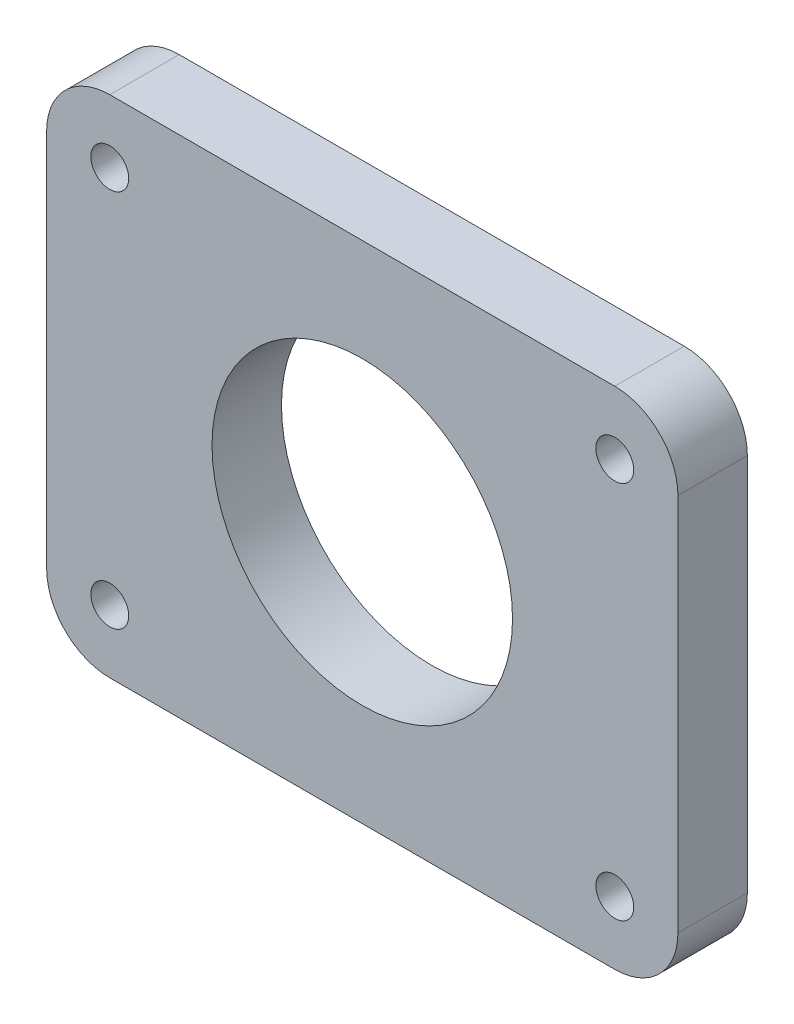
ISO-10303-21;
HEADER;
FILE_DESCRIPTION(('STEP AP214'),'2;1');
FILE_NAME('part.step','',(''),(''),'','','');
FILE_SCHEMA(('AUTOMOTIVE_DESIGN { 1 0 10303 214 1 1 1 1 }'));
ENDSEC;
DATA;
#1=APPLICATION_CONTEXT('core data for automotive mechanical design processes');
#2=APPLICATION_PROTOCOL_DEFINITION('international standard','automotive_design',2000,#1);
#3=PRODUCT_CONTEXT('',#1,'mechanical');
#4=PRODUCT('Part','Part','',(#3));
#5=PRODUCT_RELATED_PRODUCT_CATEGORY('part','',(#4));
#6=PRODUCT_DEFINITION_FORMATION('','',#4);
#7=PRODUCT_DEFINITION_CONTEXT('part definition',#1,'design');
#8=PRODUCT_DEFINITION('design','',#6,#7);
#9=PRODUCT_DEFINITION_SHAPE('','',#8);
#10=(LENGTH_UNIT() NAMED_UNIT(*) SI_UNIT(.MILLI.,.METRE.));
#11=(NAMED_UNIT(*) PLANE_ANGLE_UNIT() SI_UNIT($,.RADIAN.));
#12=(NAMED_UNIT(*) SI_UNIT($,.STERADIAN.) SOLID_ANGLE_UNIT());
#13=UNCERTAINTY_MEASURE_WITH_UNIT(LENGTH_MEASURE(1.E-05),#10,'distance_accuracy_value','');
#14=(GEOMETRIC_REPRESENTATION_CONTEXT(3) GLOBAL_UNCERTAINTY_ASSIGNED_CONTEXT((#13)) GLOBAL_UNIT_ASSIGNED_CONTEXT((#10,
#11,#12)) REPRESENTATION_CONTEXT('',''));
#15=CARTESIAN_POINT('',(0.,0.,0.));
#16=DIRECTION('',(0.,0.,1.));
#17=DIRECTION('',(1.,0.,0.));
#18=AXIS2_PLACEMENT_3D('',#15,#16,#17);
#19=CARTESIAN_POINT('',(-20.,-15.,5.5));
#20=DIRECTION('',(0.,0.,-1.));
#21=DIRECTION('',(-1.,0.,0.));
#22=AXIS2_PLACEMENT_3D('',#19,#20,#21);
#23=PLANE('',#22);
#24=CARTESIAN_POINT('',(-20.,-15.,5.5));
#25=DIRECTION('',(0.,0.,1.));
#26=DIRECTION('',(-1.,0.,0.));
#27=AXIS2_PLACEMENT_3D('',#24,#25,#26);
#28=CIRCLE('',#27,5.);
#29=CARTESIAN_POINT('',(-25.,-15.,5.5));
#30=VERTEX_POINT('',#29);
#31=CARTESIAN_POINT('',(-20.,-20.,5.5));
#32=VERTEX_POINT('',#31);
#33=EDGE_CURVE('E144',#30,#32,#28,.T.);
#34=ORIENTED_EDGE('',*,*,#33,.T.);
#35=DIRECTION('',(1.,0.,0.));
#36=VECTOR('',#35,1.);
#37=CARTESIAN_POINT('',(-20.,-20.,5.5));
#38=LINE('',#37,#36);
#39=CARTESIAN_POINT('',(20.,-20.,5.5));
#40=VERTEX_POINT('',#39);
#41=EDGE_CURVE('E92',#32,#40,#38,.T.);
#42=ORIENTED_EDGE('',*,*,#41,.T.);
#43=CARTESIAN_POINT('',(20.,-15.,5.5));
#44=DIRECTION('',(0.,0.,1.));
#45=DIRECTION('',(-1.,0.,0.));
#46=AXIS2_PLACEMENT_3D('',#43,#44,#45);
#47=CIRCLE('',#46,5.);
#48=CARTESIAN_POINT('',(25.,-15.,5.5));
#49=VERTEX_POINT('',#48);
#50=EDGE_CURVE('E159',#40,#49,#47,.T.);
#51=ORIENTED_EDGE('',*,*,#50,.T.);
#52=DIRECTION('',(0.,1.,0.));
#53=VECTOR('',#52,1.);
#54=CARTESIAN_POINT('',(25.,15.,5.5));
#55=LINE('',#54,#53);
#56=CARTESIAN_POINT('',(25.,15.,5.5));
#57=VERTEX_POINT('',#56);
#58=EDGE_CURVE('E172',#49,#57,#55,.T.);
#59=ORIENTED_EDGE('',*,*,#58,.T.);
#60=CARTESIAN_POINT('',(20.,15.,5.5));
#61=DIRECTION('',(0.,0.,1.));
#62=DIRECTION('',(-1.,0.,0.));
#63=AXIS2_PLACEMENT_3D('',#60,#61,#62);
#64=CIRCLE('',#63,5.);
#65=CARTESIAN_POINT('',(20.,20.,5.5));
#66=VERTEX_POINT('',#65);
#67=EDGE_CURVE('E111',#57,#66,#64,.T.);
#68=ORIENTED_EDGE('',*,*,#67,.T.);
#69=DIRECTION('',(-1.,0.,0.));
#70=VECTOR('',#69,1.);
#71=CARTESIAN_POINT('',(-20.,20.,5.5));
#72=LINE('',#71,#70);
#73=CARTESIAN_POINT('',(-20.,20.,5.5));
#74=VERTEX_POINT('',#73);
#75=EDGE_CURVE('E105',#66,#74,#72,.T.);
#76=ORIENTED_EDGE('',*,*,#75,.T.);
#77=CARTESIAN_POINT('',(-20.,15.,5.5));
#78=DIRECTION('',(0.,0.,1.));
#79=DIRECTION('',(1.,0.,0.));
#80=AXIS2_PLACEMENT_3D('',#77,#78,#79);
#81=CIRCLE('',#80,5.);
#82=CARTESIAN_POINT('',(-25.,15.,5.5));
#83=VERTEX_POINT('',#82);
#84=EDGE_CURVE('E109',#74,#83,#81,.T.);
#85=ORIENTED_EDGE('',*,*,#84,.T.);
#86=DIRECTION('',(0.,-1.,0.));
#87=VECTOR('',#86,1.);
#88=CARTESIAN_POINT('',(-25.,15.,5.5));
#89=LINE('',#88,#87);
#90=EDGE_CURVE('E49',#83,#30,#89,.T.);
#91=ORIENTED_EDGE('',*,*,#90,.T.);
#92=EDGE_LOOP('',(#34,#42,#51,#59,#68,#76,#85,#91));
#93=FACE_BOUND('',#92,.T.);
#94=CARTESIAN_POINT('',(-20.,15.,5.5));
#95=DIRECTION('',(0.,0.,1.));
#96=DIRECTION('',(1.,0.,0.));
#97=AXIS2_PLACEMENT_3D('',#94,#95,#96);
#98=CIRCLE('',#97,1.5);
#99=CARTESIAN_POINT('',(-18.5,15.,5.5));
#100=VERTEX_POINT('',#99);
#101=EDGE_CURVE('E133',#100,#100,#98,.T.);
#102=ORIENTED_EDGE('',*,*,#101,.F.);
#103=EDGE_LOOP('',(#102));
#104=FACE_BOUND('',#103,.T.);
#105=CARTESIAN_POINT('',(0.,0.,5.5));
#106=DIRECTION('',(0.,0.,1.));
#107=DIRECTION('',(1.,0.,0.));
#108=AXIS2_PLACEMENT_3D('',#105,#106,#107);
#109=CIRCLE('',#108,11.9);
#110=CARTESIAN_POINT('',(11.9,0.,5.5));
#111=VERTEX_POINT('',#110);
#112=EDGE_CURVE('E181',#111,#111,#109,.T.);
#113=ORIENTED_EDGE('',*,*,#112,.F.);
#114=EDGE_LOOP('',(#113));
#115=FACE_BOUND('',#114,.T.);
#116=CARTESIAN_POINT('',(-20.,-15.,5.5));
#117=DIRECTION('',(0.,0.,1.));
#118=DIRECTION('',(1.,0.,0.));
#119=AXIS2_PLACEMENT_3D('',#116,#117,#118);
#120=CIRCLE('',#119,1.5);
#121=CARTESIAN_POINT('',(-18.5,-15.,5.5));
#122=VERTEX_POINT('',#121);
#123=EDGE_CURVE('E187',#122,#122,#120,.T.);
#124=ORIENTED_EDGE('',*,*,#123,.F.);
#125=EDGE_LOOP('',(#124));
#126=FACE_BOUND('',#125,.T.);
#127=CARTESIAN_POINT('',(20.,-15.,5.5));
#128=DIRECTION('',(0.,0.,1.));
#129=DIRECTION('',(1.,0.,0.));
#130=AXIS2_PLACEMENT_3D('',#127,#128,#129);
#131=CIRCLE('',#130,1.5);
#132=CARTESIAN_POINT('',(21.5,-15.,5.5));
#133=VERTEX_POINT('',#132);
#134=EDGE_CURVE('E193',#133,#133,#131,.T.);
#135=ORIENTED_EDGE('',*,*,#134,.F.);
#136=EDGE_LOOP('',(#135));
#137=FACE_BOUND('',#136,.T.);
#138=CARTESIAN_POINT('',(20.,15.,5.5));
#139=DIRECTION('',(0.,0.,1.));
#140=DIRECTION('',(1.,0.,0.));
#141=AXIS2_PLACEMENT_3D('',#138,#139,#140);
#142=CIRCLE('',#141,1.5);
#143=CARTESIAN_POINT('',(21.5,15.,5.5));
#144=VERTEX_POINT('',#143);
#145=EDGE_CURVE('E199',#144,#144,#142,.T.);
#146=ORIENTED_EDGE('',*,*,#145,.F.);
#147=EDGE_LOOP('',(#146));
#148=FACE_BOUND('',#147,.T.);
#149=ADVANCED_FACE('F32',(#93,#104,#115,#126,#137,#148),#23,.F.);
#150=CARTESIAN_POINT('',(-20.,-15.,0.));
#151=DIRECTION('',(0.,0.,-1.));
#152=DIRECTION('',(-1.,0.,0.));
#153=AXIS2_PLACEMENT_3D('',#150,#151,#152);
#154=PLANE('',#153);
#155=CARTESIAN_POINT('',(20.,-15.,0.));
#156=DIRECTION('',(0.,0.,1.));
#157=DIRECTION('',(1.,0.,0.));
#158=AXIS2_PLACEMENT_3D('',#155,#156,#157);
#159=CIRCLE('',#158,1.5);
#160=CARTESIAN_POINT('',(21.5,-15.,0.));
#161=VERTEX_POINT('',#160);
#162=EDGE_CURVE('E196',#161,#161,#159,.T.);
#163=ORIENTED_EDGE('',*,*,#162,.T.);
#164=EDGE_LOOP('',(#163));
#165=FACE_BOUND('',#164,.T.);
#166=CARTESIAN_POINT('',(0.,0.,0.));
#167=DIRECTION('',(0.,0.,1.));
#168=DIRECTION('',(1.,0.,0.));
#169=AXIS2_PLACEMENT_3D('',#166,#167,#168);
#170=CIRCLE('',#169,11.9);
#171=CARTESIAN_POINT('',(11.9,0.,0.));
#172=VERTEX_POINT('',#171);
#173=EDGE_CURVE('E184',#172,#172,#170,.T.);
#174=ORIENTED_EDGE('',*,*,#173,.T.);
#175=EDGE_LOOP('',(#174));
#176=FACE_BOUND('',#175,.T.);
#177=CARTESIAN_POINT('',(-20.,-15.,0.));
#178=DIRECTION('',(0.,0.,1.));
#179=DIRECTION('',(-1.,0.,0.));
#180=AXIS2_PLACEMENT_3D('',#177,#178,#179);
#181=CIRCLE('',#180,5.);
#182=CARTESIAN_POINT('',(-25.,-15.,0.));
#183=VERTEX_POINT('',#182);
#184=CARTESIAN_POINT('',(-20.,-20.,0.));
#185=VERTEX_POINT('',#184);
#186=EDGE_CURVE('E129',#183,#185,#181,.T.);
#187=ORIENTED_EDGE('',*,*,#186,.F.);
#188=DIRECTION('',(0.,-1.,0.));
#189=VECTOR('',#188,1.);
#190=CARTESIAN_POINT('',(-25.,15.,0.));
#191=LINE('',#190,#189);
#192=CARTESIAN_POINT('',(-25.,15.,0.));
#193=VERTEX_POINT('',#192);
#194=EDGE_CURVE('E84',#193,#183,#191,.T.);
#195=ORIENTED_EDGE('',*,*,#194,.F.);
#196=CARTESIAN_POINT('',(-20.,15.,0.));
#197=DIRECTION('',(0.,0.,1.));
#198=DIRECTION('',(1.,0.,0.));
#199=AXIS2_PLACEMENT_3D('',#196,#197,#198);
#200=CIRCLE('',#199,5.);
#201=CARTESIAN_POINT('',(-20.,20.,0.));
#202=VERTEX_POINT('',#201);
#203=EDGE_CURVE('E78',#202,#193,#200,.T.);
#204=ORIENTED_EDGE('',*,*,#203,.F.);
#205=DIRECTION('',(-1.,0.,0.));
#206=VECTOR('',#205,1.);
#207=CARTESIAN_POINT('',(-20.,20.,0.));
#208=LINE('',#207,#206);
#209=CARTESIAN_POINT('',(20.,20.,0.));
#210=VERTEX_POINT('',#209);
#211=EDGE_CURVE('E119',#210,#202,#208,.T.);
#212=ORIENTED_EDGE('',*,*,#211,.F.);
#213=CARTESIAN_POINT('',(20.,15.,0.));
#214=DIRECTION('',(0.,0.,1.));
#215=DIRECTION('',(-1.,0.,0.));
#216=AXIS2_PLACEMENT_3D('',#213,#214,#215);
#217=CIRCLE('',#216,5.);
#218=CARTESIAN_POINT('',(25.,15.,0.));
#219=VERTEX_POINT('',#218);
#220=EDGE_CURVE('E139',#219,#210,#217,.T.);
#221=ORIENTED_EDGE('',*,*,#220,.F.);
#222=DIRECTION('',(0.,1.,0.));
#223=VECTOR('',#222,1.);
#224=CARTESIAN_POINT('',(25.,15.,0.));
#225=LINE('',#224,#223);
#226=CARTESIAN_POINT('',(25.,-15.,0.));
#227=VERTEX_POINT('',#226);
#228=EDGE_CURVE('E137',#227,#219,#225,.T.);
#229=ORIENTED_EDGE('',*,*,#228,.F.);
#230=CARTESIAN_POINT('',(20.,-15.,0.));
#231=DIRECTION('',(0.,0.,1.));
#232=DIRECTION('',(-1.,0.,0.));
#233=AXIS2_PLACEMENT_3D('',#230,#231,#232);
#234=CIRCLE('',#233,5.);
#235=CARTESIAN_POINT('',(20.,-20.,0.));
#236=VERTEX_POINT('',#235);
#237=EDGE_CURVE('E135',#236,#227,#234,.T.);
#238=ORIENTED_EDGE('',*,*,#237,.F.);
#239=DIRECTION('',(1.,0.,0.));
#240=VECTOR('',#239,1.);
#241=CARTESIAN_POINT('',(-20.,-20.,0.));
#242=LINE('',#241,#240);
#243=EDGE_CURVE('E132',#185,#236,#242,.T.);
#244=ORIENTED_EDGE('',*,*,#243,.F.);
#245=EDGE_LOOP('',(#187,#195,#204,#212,#221,#229,#238,#244));
#246=FACE_BOUND('',#245,.T.);
#247=CARTESIAN_POINT('',(-20.,15.,0.));
#248=DIRECTION('',(0.,0.,1.));
#249=DIRECTION('',(1.,0.,0.));
#250=AXIS2_PLACEMENT_3D('',#247,#248,#249);
#251=CIRCLE('',#250,1.5);
#252=CARTESIAN_POINT('',(-18.5,15.,0.));
#253=VERTEX_POINT('',#252);
#254=EDGE_CURVE('E178',#253,#253,#251,.T.);
#255=ORIENTED_EDGE('',*,*,#254,.T.);
#256=EDGE_LOOP('',(#255));
#257=FACE_BOUND('',#256,.T.);
#258=CARTESIAN_POINT('',(-20.,-15.,0.));
#259=DIRECTION('',(0.,0.,1.));
#260=DIRECTION('',(1.,0.,0.));
#261=AXIS2_PLACEMENT_3D('',#258,#259,#260);
#262=CIRCLE('',#261,1.5);
#263=CARTESIAN_POINT('',(-18.5,-15.,0.));
#264=VERTEX_POINT('',#263);
#265=EDGE_CURVE('E190',#264,#264,#262,.T.);
#266=ORIENTED_EDGE('',*,*,#265,.T.);
#267=EDGE_LOOP('',(#266));
#268=FACE_BOUND('',#267,.T.);
#269=CARTESIAN_POINT('',(20.,15.,0.));
#270=DIRECTION('',(0.,0.,1.));
#271=DIRECTION('',(1.,0.,0.));
#272=AXIS2_PLACEMENT_3D('',#269,#270,#271);
#273=CIRCLE('',#272,1.5);
#274=CARTESIAN_POINT('',(21.5,15.,0.));
#275=VERTEX_POINT('',#274);
#276=EDGE_CURVE('E202',#275,#275,#273,.T.);
#277=ORIENTED_EDGE('',*,*,#276,.T.);
#278=EDGE_LOOP('',(#277));
#279=FACE_BOUND('',#278,.T.);
#280=ADVANCED_FACE('F163',(#165,#176,#246,#257,#268,#279),#154,.T.);
#281=CARTESIAN_POINT('',(-20.,-15.,5.5));
#282=DIRECTION('',(0.,0.,-1.));
#283=DIRECTION('',(-1.,0.,0.));
#284=AXIS2_PLACEMENT_3D('',#281,#282,#283);
#285=CYLINDRICAL_SURFACE('',#284,5.);
#286=ORIENTED_EDGE('',*,*,#186,.T.);
#287=DIRECTION('',(0.,0.,-1.));
#288=VECTOR('',#287,1.);
#289=CARTESIAN_POINT('',(-20.,-20.,5.5));
#290=LINE('',#289,#288);
#291=EDGE_CURVE('E11',#32,#185,#290,.T.);
#292=ORIENTED_EDGE('',*,*,#291,.F.);
#293=ORIENTED_EDGE('',*,*,#33,.F.);
#294=DIRECTION('',(0.,0.,-1.));
#295=VECTOR('',#294,1.);
#296=CARTESIAN_POINT('',(-25.,-15.,5.5));
#297=LINE('',#296,#295);
#298=EDGE_CURVE('E125',#30,#183,#297,.T.);
#299=ORIENTED_EDGE('',*,*,#298,.T.);
#300=EDGE_LOOP('',(#286,#292,#293,#299));
#301=FACE_BOUND('',#300,.T.);
#302=ADVANCED_FACE('F34',(#301),#285,.T.);
#303=CARTESIAN_POINT('',(-20.,-20.,5.5));
#304=DIRECTION('',(0.,1.,0.));
#305=DIRECTION('',(0.,0.,1.));
#306=AXIS2_PLACEMENT_3D('',#303,#304,#305);
#307=PLANE('',#306);
#308=ORIENTED_EDGE('',*,*,#243,.T.);
#309=DIRECTION('',(0.,0.,-1.));
#310=VECTOR('',#309,1.);
#311=CARTESIAN_POINT('',(20.,-20.,5.5));
#312=LINE('',#311,#310);
#313=EDGE_CURVE('E41',#40,#236,#312,.T.);
#314=ORIENTED_EDGE('',*,*,#313,.F.);
#315=ORIENTED_EDGE('',*,*,#41,.F.);
#316=ORIENTED_EDGE('',*,*,#291,.T.);
#317=EDGE_LOOP('',(#308,#314,#315,#316));
#318=FACE_BOUND('',#317,.T.);
#319=ADVANCED_FACE('F234',(#318),#307,.F.);
#320=CARTESIAN_POINT('',(20.,-15.,5.5));
#321=DIRECTION('',(0.,0.,-1.));
#322=DIRECTION('',(-1.,0.,0.));
#323=AXIS2_PLACEMENT_3D('',#320,#321,#322);
#324=CYLINDRICAL_SURFACE('',#323,5.);
#325=ORIENTED_EDGE('',*,*,#237,.T.);
#326=DIRECTION('',(0.,0.,-1.));
#327=VECTOR('',#326,1.);
#328=CARTESIAN_POINT('',(25.,-15.,5.5));
#329=LINE('',#328,#327);
#330=EDGE_CURVE('E151',#49,#227,#329,.T.);
#331=ORIENTED_EDGE('',*,*,#330,.F.);
#332=ORIENTED_EDGE('',*,*,#50,.F.);
#333=ORIENTED_EDGE('',*,*,#313,.T.);
#334=EDGE_LOOP('',(#325,#331,#332,#333));
#335=FACE_BOUND('',#334,.T.);
#336=ADVANCED_FACE('F157',(#335),#324,.T.);
#337=CARTESIAN_POINT('',(25.,15.,5.5));
#338=DIRECTION('',(-1.,0.,0.));
#339=DIRECTION('',(0.,0.,1.));
#340=AXIS2_PLACEMENT_3D('',#337,#338,#339);
#341=PLANE('',#340);
#342=ORIENTED_EDGE('',*,*,#228,.T.);
#343=DIRECTION('',(0.,0.,-1.));
#344=VECTOR('',#343,1.);
#345=CARTESIAN_POINT('',(25.,15.,5.5));
#346=LINE('',#345,#344);
#347=EDGE_CURVE('E148',#57,#219,#346,.T.);
#348=ORIENTED_EDGE('',*,*,#347,.F.);
#349=ORIENTED_EDGE('',*,*,#58,.F.);
#350=ORIENTED_EDGE('',*,*,#330,.T.);
#351=EDGE_LOOP('',(#342,#348,#349,#350));
#352=FACE_BOUND('',#351,.T.);
#353=ADVANCED_FACE('F168',(#352),#341,.F.);
#354=CARTESIAN_POINT('',(20.,15.,5.5));
#355=DIRECTION('',(0.,0.,-1.));
#356=DIRECTION('',(-1.,0.,0.));
#357=AXIS2_PLACEMENT_3D('',#354,#355,#356);
#358=CYLINDRICAL_SURFACE('',#357,5.);
#359=ORIENTED_EDGE('',*,*,#220,.T.);
#360=DIRECTION('',(0.,0.,-1.));
#361=VECTOR('',#360,1.);
#362=CARTESIAN_POINT('',(20.,20.,5.5));
#363=LINE('',#362,#361);
#364=EDGE_CURVE('E120',#66,#210,#363,.T.);
#365=ORIENTED_EDGE('',*,*,#364,.F.);
#366=ORIENTED_EDGE('',*,*,#67,.F.);
#367=ORIENTED_EDGE('',*,*,#347,.T.);
#368=EDGE_LOOP('',(#359,#365,#366,#367));
#369=FACE_BOUND('',#368,.T.);
#370=ADVANCED_FACE('F171',(#369),#358,.T.);
#371=CARTESIAN_POINT('',(-20.,20.,5.5));
#372=DIRECTION('',(0.,-1.,0.));
#373=DIRECTION('',(0.,0.,-1.));
#374=AXIS2_PLACEMENT_3D('',#371,#372,#373);
#375=PLANE('',#374);
#376=ORIENTED_EDGE('',*,*,#211,.T.);
#377=DIRECTION('',(0.,0.,-1.));
#378=VECTOR('',#377,1.);
#379=CARTESIAN_POINT('',(-20.,20.,5.5));
#380=LINE('',#379,#378);
#381=EDGE_CURVE('E116',#74,#202,#380,.T.);
#382=ORIENTED_EDGE('',*,*,#381,.F.);
#383=ORIENTED_EDGE('',*,*,#75,.F.);
#384=ORIENTED_EDGE('',*,*,#364,.T.);
#385=EDGE_LOOP('',(#376,#382,#383,#384));
#386=FACE_BOUND('',#385,.T.);
#387=ADVANCED_FACE('F117',(#386),#375,.F.);
#388=CARTESIAN_POINT('',(-20.,15.,5.5));
#389=DIRECTION('',(0.,0.,-1.));
#390=DIRECTION('',(-1.,0.,0.));
#391=AXIS2_PLACEMENT_3D('',#388,#389,#390);
#392=CYLINDRICAL_SURFACE('',#391,5.);
#393=ORIENTED_EDGE('',*,*,#203,.T.);
#394=DIRECTION('',(0.,0.,-1.));
#395=VECTOR('',#394,1.);
#396=CARTESIAN_POINT('',(-25.,15.,5.5));
#397=LINE('',#396,#395);
#398=EDGE_CURVE('E121',#83,#193,#397,.T.);
#399=ORIENTED_EDGE('',*,*,#398,.F.);
#400=ORIENTED_EDGE('',*,*,#84,.F.);
#401=ORIENTED_EDGE('',*,*,#381,.T.);
#402=EDGE_LOOP('',(#393,#399,#400,#401));
#403=FACE_BOUND('',#402,.T.);
#404=ADVANCED_FACE('F123',(#403),#392,.T.);
#405=CARTESIAN_POINT('',(-25.,15.,5.5));
#406=DIRECTION('',(1.,0.,0.));
#407=DIRECTION('',(0.,0.,-1.));
#408=AXIS2_PLACEMENT_3D('',#405,#406,#407);
#409=PLANE('',#408);
#410=ORIENTED_EDGE('',*,*,#194,.T.);
#411=ORIENTED_EDGE('',*,*,#298,.F.);
#412=ORIENTED_EDGE('',*,*,#90,.F.);
#413=ORIENTED_EDGE('',*,*,#398,.T.);
#414=EDGE_LOOP('',(#410,#411,#412,#413));
#415=FACE_BOUND('',#414,.T.);
#416=ADVANCED_FACE('F222',(#415),#409,.F.);
#417=CARTESIAN_POINT('',(-20.,15.,5.5));
#418=DIRECTION('',(0.,0.,-1.));
#419=DIRECTION('',(-1.,0.,0.));
#420=AXIS2_PLACEMENT_3D('',#417,#418,#419);
#421=CYLINDRICAL_SURFACE('',#420,1.5);
#422=ORIENTED_EDGE('',*,*,#101,.T.);
#423=EDGE_LOOP('',(#422));
#424=FACE_BOUND('',#423,.T.);
#425=ORIENTED_EDGE('',*,*,#254,.F.);
#426=EDGE_LOOP('',(#425));
#427=FACE_BOUND('',#426,.T.);
#428=ADVANCED_FACE('F219',(#424,#427),#421,.F.);
#429=CARTESIAN_POINT('',(0.,0.,5.5));
#430=DIRECTION('',(0.,0.,-1.));
#431=DIRECTION('',(-1.,0.,0.));
#432=AXIS2_PLACEMENT_3D('',#429,#430,#431);
#433=CYLINDRICAL_SURFACE('',#432,11.9);
#434=ORIENTED_EDGE('',*,*,#112,.T.);
#435=EDGE_LOOP('',(#434));
#436=FACE_BOUND('',#435,.T.);
#437=ORIENTED_EDGE('',*,*,#173,.F.);
#438=EDGE_LOOP('',(#437));
#439=FACE_BOUND('',#438,.T.);
#440=ADVANCED_FACE('F298',(#436,#439),#433,.F.);
#441=CARTESIAN_POINT('',(-20.,-15.,5.5));
#442=DIRECTION('',(0.,0.,-1.));
#443=DIRECTION('',(-1.,0.,0.));
#444=AXIS2_PLACEMENT_3D('',#441,#442,#443);
#445=CYLINDRICAL_SURFACE('',#444,1.5);
#446=ORIENTED_EDGE('',*,*,#123,.T.);
#447=EDGE_LOOP('',(#446));
#448=FACE_BOUND('',#447,.T.);
#449=ORIENTED_EDGE('',*,*,#265,.F.);
#450=EDGE_LOOP('',(#449));
#451=FACE_BOUND('',#450,.T.);
#452=ADVANCED_FACE('F306',(#448,#451),#445,.F.);
#453=CARTESIAN_POINT('',(20.,-15.,5.5));
#454=DIRECTION('',(0.,0.,-1.));
#455=DIRECTION('',(-1.,0.,0.));
#456=AXIS2_PLACEMENT_3D('',#453,#454,#455);
#457=CYLINDRICAL_SURFACE('',#456,1.5);
#458=ORIENTED_EDGE('',*,*,#134,.T.);
#459=EDGE_LOOP('',(#458));
#460=FACE_BOUND('',#459,.T.);
#461=ORIENTED_EDGE('',*,*,#162,.F.);
#462=EDGE_LOOP('',(#461));
#463=FACE_BOUND('',#462,.T.);
#464=ADVANCED_FACE('F314',(#460,#463),#457,.F.);
#465=CARTESIAN_POINT('',(20.,15.,5.5));
#466=DIRECTION('',(0.,0.,-1.));
#467=DIRECTION('',(-1.,0.,0.));
#468=AXIS2_PLACEMENT_3D('',#465,#466,#467);
#469=CYLINDRICAL_SURFACE('',#468,1.5);
#470=ORIENTED_EDGE('',*,*,#145,.T.);
#471=EDGE_LOOP('',(#470));
#472=FACE_BOUND('',#471,.T.);
#473=ORIENTED_EDGE('',*,*,#276,.F.);
#474=EDGE_LOOP('',(#473));
#475=FACE_BOUND('',#474,.T.);
#476=ADVANCED_FACE('F208',(#472,#475),#469,.F.);
#477=CLOSED_SHELL('',(#149,#280,#302,#319,#336,#353,#370,#387,#404,#416,#428,#440,#452,#464,#476));
#478=MANIFOLD_SOLID_BREP('B2',#477);
#479=ADVANCED_BREP_SHAPE_REPRESENTATION('',(#18,#478),#14);
#480=SHAPE_DEFINITION_REPRESENTATION(#9,#479);
ENDSEC;
END-ISO-10303-21;
